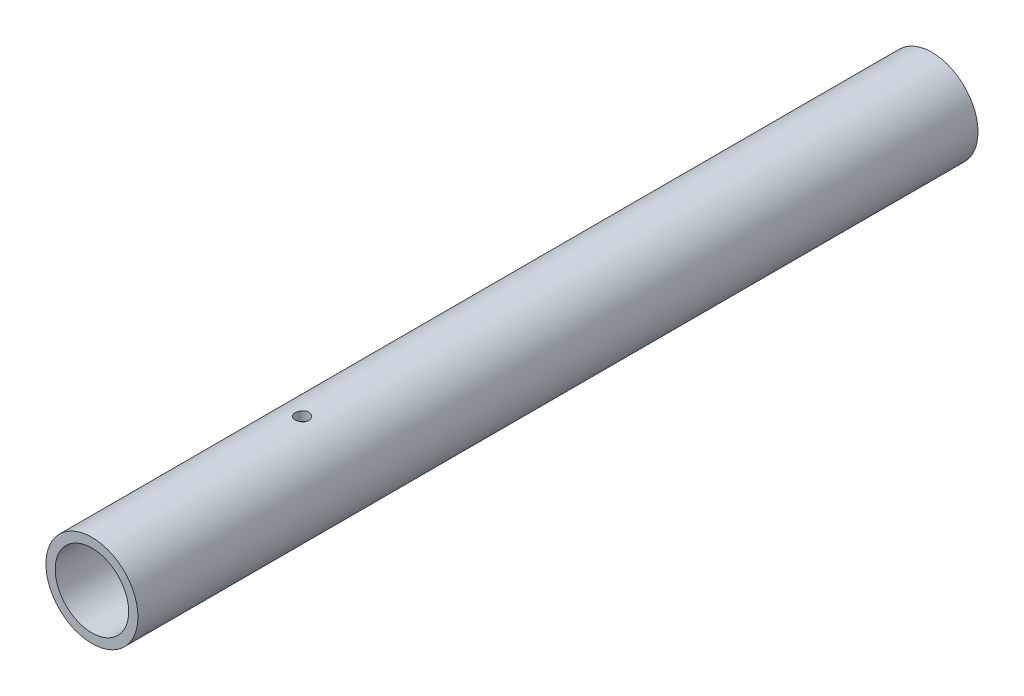
ISO-10303-21;
HEADER;
FILE_DESCRIPTION(('STEP AP214'),'2;1');
FILE_NAME('part.step','',(''),(''),'','','');
FILE_SCHEMA(('AUTOMOTIVE_DESIGN { 1 0 10303 214 1 1 1 1 }'));
ENDSEC;
DATA;
#1=APPLICATION_CONTEXT('core data for automotive mechanical design processes');
#2=APPLICATION_PROTOCOL_DEFINITION('international standard','automotive_design',2000,#1);
#3=PRODUCT_CONTEXT('',#1,'mechanical');
#4=PRODUCT('Part','Part','',(#3));
#5=PRODUCT_RELATED_PRODUCT_CATEGORY('part','',(#4));
#6=PRODUCT_DEFINITION_FORMATION('','',#4);
#7=PRODUCT_DEFINITION_CONTEXT('part definition',#1,'design');
#8=PRODUCT_DEFINITION('design','',#6,#7);
#9=PRODUCT_DEFINITION_SHAPE('','',#8);
#10=(LENGTH_UNIT() NAMED_UNIT(*) SI_UNIT(.MILLI.,.METRE.));
#11=(NAMED_UNIT(*) PLANE_ANGLE_UNIT() SI_UNIT($,.RADIAN.));
#12=(NAMED_UNIT(*) SI_UNIT($,.STERADIAN.) SOLID_ANGLE_UNIT());
#13=UNCERTAINTY_MEASURE_WITH_UNIT(LENGTH_MEASURE(1.E-05),#10,'distance_accuracy_value','');
#14=(GEOMETRIC_REPRESENTATION_CONTEXT(3) GLOBAL_UNCERTAINTY_ASSIGNED_CONTEXT((#13)) GLOBAL_UNIT_ASSIGNED_CONTEXT((#10,
#11,#12)) REPRESENTATION_CONTEXT('',''));
#15=CARTESIAN_POINT('',(0.,0.,0.));
#16=DIRECTION('',(0.,0.,1.));
#17=DIRECTION('',(1.,0.,0.));
#18=AXIS2_PLACEMENT_3D('',#15,#16,#17);
#19=CARTESIAN_POINT('',(-21.082,21.082,-304.8));
#20=DIRECTION('',(0.,0.,1.));
#21=DIRECTION('',(1.,0.,0.));
#22=AXIS2_PLACEMENT_3D('',#19,#20,#21);
#23=CYLINDRICAL_SURFACE('',#22,13.335);
#24=CARTESIAN_POINT('',(-21.082,21.082,-304.8));
#25=DIRECTION('',(0.,0.,1.));
#26=DIRECTION('',(1.,0.,0.));
#27=AXIS2_PLACEMENT_3D('',#24,#25,#26);
#28=CIRCLE('',#27,13.335);
#29=CARTESIAN_POINT('',(-7.747,21.082,-304.8));
#30=VERTEX_POINT('',#29);
#31=EDGE_CURVE('E24',#30,#30,#28,.T.);
#32=ORIENTED_EDGE('',*,*,#31,.F.);
#33=EDGE_LOOP('',(#32));
#34=FACE_BOUND('',#33,.T.);
#35=CARTESIAN_POINT('',(-21.082,21.082,0.));
#36=DIRECTION('',(0.,0.,1.));
#37=DIRECTION('',(1.,0.,0.));
#38=AXIS2_PLACEMENT_3D('',#35,#36,#37);
#39=CIRCLE('',#38,13.335);
#40=CARTESIAN_POINT('',(-7.747,21.082,0.));
#41=VERTEX_POINT('',#40);
#42=EDGE_CURVE('E38',#41,#41,#39,.T.);
#43=ORIENTED_EDGE('',*,*,#42,.T.);
#44=EDGE_LOOP('',(#43));
#45=FACE_BOUND('',#44,.T.);
#46=CARTESIAN_POINT('',(-21.082,7.747,-78.65745));
#47=CARTESIAN_POINT('',(-21.2187948592161,7.74700246138851,-78.6574447279434));
#48=CARTESIAN_POINT('',(-21.3556588089519,7.74912669516432,-78.6459892993906));
#49=CARTESIAN_POINT('',(-21.6255328892023,7.75739597096117,-78.6004980658493));
#50=CARTESIAN_POINT('',(-21.7585396182342,7.7635444555255,-78.5664429276031));
#51=CARTESIAN_POINT('',(-22.0167570063155,7.77917414800193,-78.4768280336677));
#52=CARTESIAN_POINT('',(-22.1419744849863,7.78865239090288,-78.4212874054762));
#53=CARTESIAN_POINT('',(-22.381301289392,7.80990543665334,-78.2903317601848));
#54=CARTESIAN_POINT('',(-22.4954115725284,7.82168004130124,-78.2149184581211));
#55=CARTESIAN_POINT('',(-22.7106192126991,7.84637781056411,-78.0454303196822));
#56=CARTESIAN_POINT('',(-22.8115692501581,7.8593116256834,-77.951169956784));
#57=CARTESIAN_POINT('',(-22.9963166393543,7.88479065235194,-77.7470625447916));
#58=CARTESIAN_POINT('',(-23.0801127842092,7.89733583650594,-77.6372143999206));
#59=CARTESIAN_POINT('',(-23.2287828884571,7.92072063313501,-77.4040131424123));
#60=CARTESIAN_POINT('',(-23.2935076576815,7.93154650780949,-77.2805634196347));
#61=CARTESIAN_POINT('',(-23.4012428236667,7.95011721664654,-77.0243098271869));
#62=CARTESIAN_POINT('',(-23.4442550265487,7.95786230706729,-76.8915067366076));
#63=CARTESIAN_POINT('',(-23.5068726758867,7.96928749596631,-76.6218902281098));
#64=CARTESIAN_POINT('',(-23.5267346384497,7.97301210848251,-76.4851383087179));
#65=CARTESIAN_POINT('',(-23.5432840700824,7.97610890094767,-76.2101961493011));
#66=CARTESIAN_POINT('',(-23.539973545933,7.97548145779287,-76.0720060348617));
#67=CARTESIAN_POINT('',(-23.5104801303221,7.96998557897495,-75.799964179379));
#68=CARTESIAN_POINT('',(-23.4845883521836,7.96517112371681,-75.6660796260605));
#69=CARTESIAN_POINT('',(-23.4111256016635,7.95192842897875,-75.4045878086399));
#70=CARTESIAN_POINT('',(-23.3635537365083,7.94350004067998,-75.2769808032834));
#71=CARTESIAN_POINT('',(-23.2477948262212,7.9239224125834,-75.0308114131764));
#72=CARTESIAN_POINT('',(-23.1794896961569,7.91275766005443,-74.9123058414145));
#73=CARTESIAN_POINT('',(-23.0242867525056,7.88897562685651,-74.6883284705087));
#74=CARTESIAN_POINT('',(-22.9373871140764,7.8763582036804,-74.5828579522129));
#75=CARTESIAN_POINT('',(-22.7458896784635,7.85085696289075,-74.3862621178351));
#76=CARTESIAN_POINT('',(-22.6410427550772,7.83797201270355,-74.2953794399826));
#77=CARTESIAN_POINT('',(-22.41746202952,7.81356408713008,-74.1324569100719));
#78=CARTESIAN_POINT('',(-22.2987280969616,7.8020411245338,-74.0604172349544));
#79=CARTESIAN_POINT('',(-22.0504947125879,7.78163342130704,-73.9371921300755));
#80=CARTESIAN_POINT('',(-21.920982766617,7.77275179868147,-73.8860313207487));
#81=CARTESIAN_POINT('',(-21.6550032946867,7.75865171938389,-73.8062582619009));
#82=CARTESIAN_POINT('',(-21.5185364836401,7.75343288701331,-73.7776436997364));
#83=CARTESIAN_POINT('',(-21.2446091877513,7.74729783901729,-73.7441117004924));
#84=CARTESIAN_POINT('',(-21.1071907192645,7.74632124742975,-73.7388617100524));
#85=CARTESIAN_POINT('',(-20.8334392593011,7.74861416766826,-73.7513167205142));
#86=CARTESIAN_POINT('',(-20.6971062166863,7.7518834782499,-73.7690206334622));
#87=CARTESIAN_POINT('',(-20.4304459559282,7.76226330061286,-73.8266043891773));
#88=CARTESIAN_POINT('',(-20.300081297479,7.76934475525787,-73.8663165461128));
#89=CARTESIAN_POINT('',(-20.0478602705809,7.78655813545782,-73.9666084838202));
#90=CARTESIAN_POINT('',(-19.9260044650044,7.79669026258393,-74.0271896435356));
#91=CARTESIAN_POINT('',(-19.6928368291016,7.81903165684358,-74.1682400760522));
#92=CARTESIAN_POINT('',(-19.5816504065329,7.83126179610768,-74.248913284951));
#93=CARTESIAN_POINT('',(-19.3742741582703,7.85638739771225,-74.4275811070687));
#94=CARTESIAN_POINT('',(-19.2780856835404,7.86928291984906,-74.5255772789865));
#95=CARTESIAN_POINT('',(-19.1021770879758,7.89448536944479,-74.737612622083));
#96=CARTESIAN_POINT('',(-19.0226835622907,7.90678264811425,-74.8518411170566));
#97=CARTESIAN_POINT('',(-18.884012814721,7.9292044022091,-75.0922256851818));
#98=CARTESIAN_POINT('',(-18.8248348539643,7.93932895665093,-75.2183813243332));
#99=CARTESIAN_POINT('',(-18.7287992161255,7.95618372699651,-75.4784544261316));
#100=CARTESIAN_POINT('',(-18.6918362442675,7.96292992983026,-75.6123319229694));
#101=CARTESIAN_POINT('',(-18.6409539378688,7.97230128953629,-75.8845325906455));
#102=CARTESIAN_POINT('',(-18.6270321017495,7.97492689378079,-76.0228552772066));
#103=CARTESIAN_POINT('',(-18.6227087345663,7.97573762670359,-76.2977513116025));
#104=CARTESIAN_POINT('',(-18.6319499077541,7.97399021106364,-76.4343189696051));
#105=CARTESIAN_POINT('',(-18.6729095536375,7.96640108859698,-76.7039189568548));
#106=CARTESIAN_POINT('',(-18.7046279027573,7.96055940427989,-76.8369513055343));
#107=CARTESIAN_POINT('',(-18.7894929713541,7.94546792055123,-77.095520882158));
#108=CARTESIAN_POINT('',(-18.8426022740794,7.93622407457414,-77.2210707603868));
#109=CARTESIAN_POINT('',(-18.9687030161139,7.91536537861531,-77.4615353759613));
#110=CARTESIAN_POINT('',(-19.0416957937877,7.90375036904277,-77.5764493967054));
#111=CARTESIAN_POINT('',(-19.2067390170938,7.87924794172376,-77.7941726100185));
#112=CARTESIAN_POINT('',(-19.2990499657535,7.86634454298404,-77.8967825650116));
#113=CARTESIAN_POINT('',(-19.499564819598,7.8408400336235,-78.0851756099915));
#114=CARTESIAN_POINT('',(-19.6077723720986,7.8282389931497,-78.1709548277576));
#115=CARTESIAN_POINT('',(-19.8381294068908,7.80463131293529,-78.3239426741416));
#116=CARTESIAN_POINT('',(-19.9603914244533,7.79363941269866,-78.3909841925568));
#117=CARTESIAN_POINT('',(-20.214604995074,7.77463226704775,-78.503468701982));
#118=CARTESIAN_POINT('',(-20.3465472195322,7.76661419979943,-78.5489321796519));
#119=CARTESIAN_POINT('',(-20.5794153798655,7.75611158584496,-78.6076351974588));
#120=CARTESIAN_POINT('',(-20.6789717553882,7.75271386847402,-78.6262841532356));
#121=CARTESIAN_POINT('',(-20.8796728460892,7.74815719207529,-78.6511933558369));
#122=CARTESIAN_POINT('',(-20.9808175231439,7.74699817939514,-78.6574538995599));
#123=CARTESIAN_POINT('',(-21.082,7.747,-78.65745));
#124=B_SPLINE_CURVE_WITH_KNOTS('',3,(#46,#47,#48,#49,#50,#51,#52,#53,#54,#55,#56,#57,#58,#59,
#60,#61,#62,#63,#64,#65,#66,#67,#68,#69,#70,#71,#72,#73,#74,#75,#76,#77,#78,#79,#80,#81,#82,#83,
#84,#85,#86,#87,#88,#89,#90,#91,#92,#93,#94,#95,#96,#97,#98,#99,#100,#101,#102,#103,#104,#105,
#106,#107,#108,#109,#110,#111,#112,#113,#114,#115,#116,#117,#118,#119,#120,#121,#122,#123),
.UNSPECIFIED.,.T.,.F.,(4,2,2,2,2,2,2,2,2,2,2,2,2,2,2,2,2,2,2,2,2,2,2,2,2,2,2,2,2,2,2,2,2,2,2,2,
2,2,4),(0.,0.41001457648515,0.820380358967035,1.23038165017484,1.64034756934889,
2.05456761964887,2.46881680287779,2.88622538554577,3.30359924109911,3.71630304912735,
4.12897111667219,4.53639649668784,4.94383865576287,5.35364635958971,5.76349429990501,
6.17957714159766,6.59566389027622,7.01223988202078,7.42877313861734,7.83935841955203,
8.24992424055249,8.6574040394724,9.06491076825971,9.47673551313093,9.88859733236826,
10.3057318683608,10.7228512316648,11.1379776091757,11.5530589134135,11.9617769992006,
12.370492837942,12.7784968402029,13.1865283121663,13.6004645260412,14.0144958621751,
14.432109733558,14.8493263161944,15.1526073380272,15.4558810913949),.UNSPECIFIED.);
#125=CARTESIAN_POINT('',(-21.082,7.747,-78.65745));
#126=VERTEX_POINT('',#125);
#127=EDGE_CURVE('E62',#126,#126,#124,.T.);
#128=ORIENTED_EDGE('',*,*,#127,.F.);
#129=EDGE_LOOP('',(#128));
#130=FACE_BOUND('',#129,.T.);
#131=CARTESIAN_POINT('',(-21.082,34.417,-78.65745));
#132=CARTESIAN_POINT('',(-20.9452051407839,34.4169975386115,-78.6574447279434));
#133=CARTESIAN_POINT('',(-20.8083411910481,34.4148733048357,-78.6459892993906));
#134=CARTESIAN_POINT('',(-20.5384671107977,34.4066040290388,-78.6004980658493));
#135=CARTESIAN_POINT('',(-20.4054603817658,34.4004555444745,-78.5664429276031));
#136=CARTESIAN_POINT('',(-20.1472429936845,34.3848258519981,-78.4768280336677));
#137=CARTESIAN_POINT('',(-20.0220255150137,34.3753476090971,-78.4212874054762));
#138=CARTESIAN_POINT('',(-19.782698710608,34.3540945633466,-78.2903317601848));
#139=CARTESIAN_POINT('',(-19.6685884274716,34.3423199586987,-78.2149184581211));
#140=CARTESIAN_POINT('',(-19.4533807873009,34.3176221894359,-78.0454303196822));
#141=CARTESIAN_POINT('',(-19.3524307498419,34.3046883743166,-77.951169956784));
#142=CARTESIAN_POINT('',(-19.1676833606457,34.2792093476481,-77.7470625447916));
#143=CARTESIAN_POINT('',(-19.0838872157908,34.2666641634941,-77.6372143999206));
#144=CARTESIAN_POINT('',(-18.9352171115429,34.243279366865,-77.4040131424123));
#145=CARTESIAN_POINT('',(-18.8704923423185,34.2324534921905,-77.2805634196347));
#146=CARTESIAN_POINT('',(-18.7627571763333,34.2138827833535,-77.0243098271869));
#147=CARTESIAN_POINT('',(-18.7197449734513,34.2061376929327,-76.8915067366076));
#148=CARTESIAN_POINT('',(-18.6571273241133,34.1947125040337,-76.6218902281098));
#149=CARTESIAN_POINT('',(-18.6372653615503,34.1909878915175,-76.4851383087179));
#150=CARTESIAN_POINT('',(-18.6207159299176,34.1878910990523,-76.2101961493011));
#151=CARTESIAN_POINT('',(-18.624026454067,34.1885185422071,-76.0720060348617));
#152=CARTESIAN_POINT('',(-18.6535198696779,34.1940144210251,-75.799964179379));
#153=CARTESIAN_POINT('',(-18.6794116478164,34.1988288762832,-75.6660796260605));
#154=CARTESIAN_POINT('',(-18.7528743983365,34.2120715710213,-75.4045878086399));
#155=CARTESIAN_POINT('',(-18.8004462634917,34.22049995932,-75.2769808032834));
#156=CARTESIAN_POINT('',(-18.9162051737788,34.2400775874166,-75.0308114131764));
#157=CARTESIAN_POINT('',(-18.9845103038431,34.2512423399456,-74.9123058414145));
#158=CARTESIAN_POINT('',(-19.1397132474944,34.2750243731435,-74.6883284705087));
#159=CARTESIAN_POINT('',(-19.2266128859236,34.2876417963196,-74.5828579522129));
#160=CARTESIAN_POINT('',(-19.4181103215365,34.3131430371093,-74.3862621178351));
#161=CARTESIAN_POINT('',(-19.5229572449228,34.3260279872964,-74.2953794399826));
#162=CARTESIAN_POINT('',(-19.74653797048,34.3504359128699,-74.1324569100719));
#163=CARTESIAN_POINT('',(-19.8652719030384,34.3619588754662,-74.0604172349544));
#164=CARTESIAN_POINT('',(-20.1135052874121,34.382366578693,-73.9371921300755));
#165=CARTESIAN_POINT('',(-20.243017233383,34.3912482013185,-73.8860313207487));
#166=CARTESIAN_POINT('',(-20.5089967053133,34.4053482806161,-73.8062582619009));
#167=CARTESIAN_POINT('',(-20.6454635163599,34.4105671129867,-73.7776436997364));
#168=CARTESIAN_POINT('',(-20.9193908122487,34.4167021609827,-73.7441117004924));
#169=CARTESIAN_POINT('',(-21.0568092807355,34.4176787525702,-73.7388617100524));
#170=CARTESIAN_POINT('',(-21.3305607406989,34.4153858323317,-73.7513167205142));
#171=CARTESIAN_POINT('',(-21.4668937833137,34.4121165217501,-73.7690206334622));
#172=CARTESIAN_POINT('',(-21.7335540440718,34.4017366993871,-73.8266043891773));
#173=CARTESIAN_POINT('',(-21.863918702521,34.3946552447421,-73.8663165461128));
#174=CARTESIAN_POINT('',(-22.1161397294191,34.3774418645422,-73.9666084838202));
#175=CARTESIAN_POINT('',(-22.2379955349956,34.3673097374161,-74.0271896435356));
#176=CARTESIAN_POINT('',(-22.4711631708984,34.3449683431564,-74.1682400760522));
#177=CARTESIAN_POINT('',(-22.5823495934671,34.3327382038923,-74.248913284951));
#178=CARTESIAN_POINT('',(-22.7897258417297,34.3076126022877,-74.4275811070687));
#179=CARTESIAN_POINT('',(-22.8859143164596,34.2947170801509,-74.5255772789865));
#180=CARTESIAN_POINT('',(-23.0618229120242,34.2695146305552,-74.737612622083));
#181=CARTESIAN_POINT('',(-23.1413164377093,34.2572173518858,-74.8518411170566));
#182=CARTESIAN_POINT('',(-23.279987185279,34.2347955977909,-75.0922256851818));
#183=CARTESIAN_POINT('',(-23.3391651460357,34.2246710433491,-75.2183813243332));
#184=CARTESIAN_POINT('',(-23.4352007838745,34.2078162730035,-75.4784544261316));
#185=CARTESIAN_POINT('',(-23.4721637557325,34.2010700701697,-75.6123319229694));
#186=CARTESIAN_POINT('',(-23.5230460621312,34.1916987104637,-75.8845325906455));
#187=CARTESIAN_POINT('',(-23.5369678982505,34.1890731062192,-76.0228552772066));
#188=CARTESIAN_POINT('',(-23.5412912654338,34.1882623732964,-76.2977513116025));
#189=CARTESIAN_POINT('',(-23.5320500922459,34.1900097889364,-76.4343189696051));
#190=CARTESIAN_POINT('',(-23.4910904463625,34.197598911403,-76.7039189568548));
#191=CARTESIAN_POINT('',(-23.4593720972427,34.2034405957201,-76.8369513055343));
#192=CARTESIAN_POINT('',(-23.3745070286459,34.2185320794488,-77.095520882158));
#193=CARTESIAN_POINT('',(-23.3213977259206,34.2277759254259,-77.2210707603868));
#194=CARTESIAN_POINT('',(-23.1952969838861,34.2486346213847,-77.4615353759613));
#195=CARTESIAN_POINT('',(-23.1223042062123,34.2602496309572,-77.5764493967054));
#196=CARTESIAN_POINT('',(-22.9572609829062,34.2847520582762,-77.7941726100185));
#197=CARTESIAN_POINT('',(-22.8649500342465,34.297655457016,-77.8967825650116));
#198=CARTESIAN_POINT('',(-22.664435180402,34.3231599663765,-78.0851756099915));
#199=CARTESIAN_POINT('',(-22.5562276279014,34.3357610068503,-78.1709548277576));
#200=CARTESIAN_POINT('',(-22.3258705931092,34.3593686870647,-78.3239426741416));
#201=CARTESIAN_POINT('',(-22.2036085755467,34.3703605873013,-78.3909841925568));
#202=CARTESIAN_POINT('',(-21.949395004926,34.3893677329523,-78.503468701982));
#203=CARTESIAN_POINT('',(-21.8174527804678,34.3973858002006,-78.5489321796519));
#204=CARTESIAN_POINT('',(-21.5845846201345,34.4078884141551,-78.6076351974588));
#205=CARTESIAN_POINT('',(-21.4850282446118,34.411286131526,-78.6262841532356));
#206=CARTESIAN_POINT('',(-21.2843271539108,34.4158428079247,-78.6511933558369));
#207=CARTESIAN_POINT('',(-21.1831824768561,34.4170018206049,-78.6574538995599));
#208=CARTESIAN_POINT('',(-21.082,34.417,-78.65745));
#209=B_SPLINE_CURVE_WITH_KNOTS('',3,(#131,#132,#133,#134,#135,#136,#137,#138,#139,#140,#141,
#142,#143,#144,#145,#146,#147,#148,#149,#150,#151,#152,#153,#154,#155,#156,#157,#158,#159,#160,
#161,#162,#163,#164,#165,#166,#167,#168,#169,#170,#171,#172,#173,#174,#175,#176,#177,#178,#179,
#180,#181,#182,#183,#184,#185,#186,#187,#188,#189,#190,#191,#192,#193,#194,#195,#196,#197,#198,
#199,#200,#201,#202,#203,#204,#205,#206,#207,#208),.UNSPECIFIED.,.T.,.F.,(4,2,2,2,2,2,2,2,2,2,2,
2,2,2,2,2,2,2,2,2,2,2,2,2,2,2,2,2,2,2,2,2,2,2,2,2,2,2,4),(0.,0.41001457648515,0.820380358967036,
1.23038165017484,1.64034756934889,2.05456761964887,2.46881680287779,2.8862253855458,
3.30359924109911,3.71630304912735,4.12897111667219,4.53639649668785,4.94383865576287,
5.35364635958971,5.76349429990501,6.17957714159766,6.59566389027623,7.01223988202077,
7.42877313861734,7.83935841955204,8.24992424055249,8.6574040394724,9.06491076825971,
9.47673551313093,9.88859733236826,10.3057318683608,10.7228512316648,11.1379776091757,
11.5530589134135,11.9617769992006,12.370492837942,12.7784968402029,13.1865283121663,
13.6004645260412,14.0144958621751,14.432109733558,14.8493263161944,15.1526073380272,
15.4558810913949),.UNSPECIFIED.);
#210=CARTESIAN_POINT('',(-21.082,34.417,-78.65745));
#211=VERTEX_POINT('',#210);
#212=EDGE_CURVE('E41',#211,#211,#209,.T.);
#213=ORIENTED_EDGE('',*,*,#212,.F.);
#214=EDGE_LOOP('',(#213));
#215=FACE_BOUND('',#214,.T.);
#216=ADVANCED_FACE('F12',(#34,#45,#130,#215),#23,.F.);
#217=CARTESIAN_POINT('',(-21.082,21.082,-304.8));
#218=DIRECTION('',(0.,0.,1.));
#219=DIRECTION('',(1.,0.,0.));
#220=AXIS2_PLACEMENT_3D('',#217,#218,#219);
#221=CYLINDRICAL_SURFACE('',#220,16.7005);
#222=CARTESIAN_POINT('',(-21.082,4.38149999999993,-78.65745));
#223=CARTESIAN_POINT('',(-21.2192410025861,4.38150217022764,-78.6574443172633));
#224=CARTESIAN_POINT('',(-21.3565623956143,4.38320947043393,-78.6459144631919));
#225=CARTESIAN_POINT('',(-21.6273689540258,4.38985592631601,-78.6001101597742));
#226=CARTESIAN_POINT('',(-21.7608502162954,4.39479825679205,-78.5658133668969));
#227=CARTESIAN_POINT('',(-22.0200180396953,4.40735919749008,-78.4755203931146));
#228=CARTESIAN_POINT('',(-22.1457103326025,4.41497581156103,-78.4195403938812));
#229=CARTESIAN_POINT('',(-22.385897404253,4.43204301368479,-78.287509131431));
#230=CARTESIAN_POINT('',(-22.5003937795525,4.44149333967203,-78.2114607357377));
#231=CARTESIAN_POINT('',(-22.7158207402294,4.46125610797714,-78.0408410916021));
#232=CARTESIAN_POINT('',(-22.8166548187989,4.47157392543233,-77.9461486019759));
#233=CARTESIAN_POINT('',(-23.0010624074876,4.49186656951296,-77.7411895979179));
#234=CARTESIAN_POINT('',(-23.0846349394977,4.50184137667537,-77.6309222015447));
#235=CARTESIAN_POINT('',(-23.2325209157727,4.52037083566303,-77.3972975113157));
#236=CARTESIAN_POINT('',(-23.2967413324265,4.52891854227709,-77.2738807317752));
#237=CARTESIAN_POINT('',(-23.4035056494003,4.54355286891186,-77.0178659029884));
#238=CARTESIAN_POINT('',(-23.4460506862938,4.54963961797227,-76.8852683355614));
#239=CARTESIAN_POINT('',(-23.5079575758216,4.55861017493004,-76.6156693841489));
#240=CARTESIAN_POINT('',(-23.5274843989345,4.56151676395097,-76.4787066534293));
#241=CARTESIAN_POINT('',(-23.5433115579708,4.5638671257459,-76.2034199981308));
#242=CARTESIAN_POINT('',(-23.5396131779794,4.563311089963,-76.0650961492283));
#243=CARTESIAN_POINT('',(-23.5092298042709,4.55881986212579,-75.7921771947428));
#244=CARTESIAN_POINT('',(-23.4827282970978,4.55491164436883,-75.6575611543372));
#245=CARTESIAN_POINT('',(-23.4077780629622,4.54419853790695,-75.3947075525631));
#246=CARTESIAN_POINT('',(-23.3593287365733,4.53739357008794,-75.2664701655109));
#247=CARTESIAN_POINT('',(-23.2416665440084,4.52162381709451,-75.019454347405));
#248=CARTESIAN_POINT('',(-23.1723757110282,4.51265094717217,-74.9007135919144));
#249=CARTESIAN_POINT('',(-23.015052973247,4.49356229566387,-74.6764751085356));
#250=CARTESIAN_POINT('',(-22.9270198840983,4.48344644187025,-74.5709782182144));
#251=CARTESIAN_POINT('',(-22.7337031901897,4.46309234898183,-74.3751585159882));
#252=CARTESIAN_POINT('',(-22.6282617795468,4.45285386871947,-74.2849914450624));
#253=CARTESIAN_POINT('',(-22.4036600538203,4.43349859776556,-74.1236095060202));
#254=CARTESIAN_POINT('',(-22.2844996826839,4.42438181165731,-74.0523947153427));
#255=CARTESIAN_POINT('',(-22.0357093989535,4.40828813116989,-73.9309318294017));
#256=CARTESIAN_POINT('',(-21.9060736736605,4.40131243531078,-73.8806954716035));
#257=CARTESIAN_POINT('',(-21.6400804191064,4.39029701398562,-73.8027494217297));
#258=CARTESIAN_POINT('',(-21.5037233276105,4.38625709758012,-73.7750382646292));
#259=CARTESIAN_POINT('',(-21.2295024730446,4.38159365374626,-73.743135682363));
#260=CARTESIAN_POINT('',(-21.0916641349996,4.38093901885359,-73.7387300929091));
#261=CARTESIAN_POINT('',(-20.8172166541374,4.38303530468459,-73.7529956484227));
#262=CARTESIAN_POINT('',(-20.6806074748632,4.38578612406444,-73.7716661066641));
#263=CARTESIAN_POINT('',(-20.4131427905492,4.39436498495105,-73.8313757006782));
#264=CARTESIAN_POINT('',(-20.2822635546725,4.40017870626027,-73.8723107697769));
#265=CARTESIAN_POINT('',(-20.0292261655705,4.41423349016355,-73.9752780368446));
#266=CARTESIAN_POINT('',(-19.9070684087839,4.42247466301131,-74.0373111930986));
#267=CARTESIAN_POINT('',(-19.6739980364468,4.44054552893848,-74.1812181108909));
#268=CARTESIAN_POINT('',(-19.5631703540769,4.45038596415434,-74.2632280559232));
#269=CARTESIAN_POINT('',(-19.356774875305,4.47052588724284,-74.4445706148625));
#270=CARTESIAN_POINT('',(-19.2612079312108,4.4808254007138,-74.5439041956418));
#271=CARTESIAN_POINT('',(-19.0872698274103,4.50082097799922,-74.7580265331705));
#272=CARTESIAN_POINT('',(-19.0090420400417,4.51051156777357,-74.8729323442112));
#273=CARTESIAN_POINT('',(-18.872998662043,4.52809597281138,-75.1143789935112));
#274=CARTESIAN_POINT('',(-18.8151825363919,4.5359898351679,-75.240919526697));
#275=CARTESIAN_POINT('',(-18.7218271060897,4.54904764859629,-75.501611777507));
#276=CARTESIAN_POINT('',(-18.6862116934773,4.55422091670073,-75.6357357532424));
#277=CARTESIAN_POINT('',(-18.6380260685937,4.561276809771,-75.9081430575069));
#278=CARTESIAN_POINT('',(-18.6254543299195,4.56315965269279,-76.0464261099238));
#279=CARTESIAN_POINT('',(-18.6237482142702,4.56341358601077,-76.3217975487836));
#280=CARTESIAN_POINT('',(-18.6343884363395,4.5618184495872,-76.4588845609534));
#281=CARTESIAN_POINT('',(-18.6783218848314,4.55536945775816,-76.7292971833747));
#282=CARTESIAN_POINT('',(-18.71161508032,4.55051560680268,-76.8626227987623));
#283=CARTESIAN_POINT('',(-18.7998308017396,4.53810773318024,-77.1216695342128));
#284=CARTESIAN_POINT('',(-18.8547381671704,4.53055560346834,-77.2473959133437));
#285=CARTESIAN_POINT('',(-18.9846012513694,4.51359971271564,-77.4878884088105));
#286=CARTESIAN_POINT('',(-19.059557597283,4.5041958937552,-77.602654182139));
#287=CARTESIAN_POINT('',(-19.2282120463707,4.4844873863608,-77.8191138162986));
#288=CARTESIAN_POINT('',(-19.3220772439782,4.47417516335743,-77.9206768138982));
#289=CARTESIAN_POINT('',(-19.5255319399101,4.45387512936404,-78.1066905461732));
#290=CARTESIAN_POINT('',(-19.6351250934428,4.44388739444926,-78.1911372919613));
#291=CARTESIAN_POINT('',(-19.8676048077276,4.42530155759623,-78.3409183780189));
#292=CARTESIAN_POINT('',(-19.9905585822699,4.41671108120421,-78.4061493188647));
#293=CARTESIAN_POINT('',(-20.2457440746554,4.40196264813273,-78.5149373896911));
#294=CARTESIAN_POINT('',(-20.3779659599812,4.39580215814263,-78.5585171038905));
#295=CARTESIAN_POINT('',(-20.6059938609505,4.3880238199316,-78.6128114887158));
#296=CARTESIAN_POINT('',(-20.7003882944617,4.38558987156475,-78.629525538698));
#297=CARTESIAN_POINT('',(-20.8905087814731,4.3823272138367,-78.6518467118515));
#298=CARTESIAN_POINT('',(-20.9862348193353,4.38149848564019,-78.6574539653478));
#299=CARTESIAN_POINT('',(-21.082,4.38149999999993,-78.65745));
#300=B_SPLINE_CURVE_WITH_KNOTS('',3,(#222,#223,#224,#225,#226,#227,#228,#229,#230,#231,#232,
#233,#234,#235,#236,#237,#238,#239,#240,#241,#242,#243,#244,#245,#246,#247,#248,#249,#250,#251,
#252,#253,#254,#255,#256,#257,#258,#259,#260,#261,#262,#263,#264,#265,#266,#267,#268,#269,#270,
#271,#272,#273,#274,#275,#276,#277,#278,#279,#280,#281,#282,#283,#284,#285,#286,#287,#288,#289,
#290,#291,#292,#293,#294,#295,#296,#297,#298,#299),.UNSPECIFIED.,.T.,.F.,(4,2,2,2,2,2,2,2,2,2,2,
2,2,2,2,2,2,2,2,2,2,2,2,2,2,2,2,2,2,2,2,2,2,2,2,2,2,2,4),(0.,0.411373088645835,0.82315049792333,
1.2346211975503,1.64603313495375,2.06021450565259,2.47441933911035,2.89058464983195,
3.30672813619849,3.71987064933668,4.13299032067574,4.54281656225306,4.9526539974467,
5.36404409199506,5.77546019053723,6.19083418843245,6.60620988351658,7.02181767156507,
7.43739842658156,7.84915352273241,8.26089636564909,8.67073102247499,9.0805842966683,
9.49331386503612,9.90606647617901,10.3221142694046,10.7381511565683,11.1527538368046,
11.5673290529477,11.9778964485713,12.3884632835396,12.7987426524889,13.2090348567502,
13.6231257305417,14.0373129961949,14.4536898970231,14.8696315618026,15.1566863025583,
15.4437376750522),.UNSPECIFIED.);
#301=CARTESIAN_POINT('',(-21.082,4.38149999999993,-78.65745));
#302=VERTEX_POINT('',#301);
#303=EDGE_CURVE('E43',#302,#302,#300,.T.);
#304=ORIENTED_EDGE('',*,*,#303,.T.);
#305=EDGE_LOOP('',(#304));
#306=FACE_BOUND('',#305,.T.);
#307=CARTESIAN_POINT('',(-21.082,21.082,-304.8));
#308=DIRECTION('',(0.,0.,1.));
#309=DIRECTION('',(1.,0.,0.));
#310=AXIS2_PLACEMENT_3D('',#307,#308,#309);
#311=CIRCLE('',#310,16.7005);
#312=CARTESIAN_POINT('',(-4.3815,21.082,-304.8));
#313=VERTEX_POINT('',#312);
#314=EDGE_CURVE('E8',#313,#313,#311,.T.);
#315=ORIENTED_EDGE('',*,*,#314,.T.);
#316=EDGE_LOOP('',(#315));
#317=FACE_BOUND('',#316,.T.);
#318=CARTESIAN_POINT('',(-21.082,21.082,0.));
#319=DIRECTION('',(0.,0.,1.));
#320=DIRECTION('',(1.,0.,0.));
#321=AXIS2_PLACEMENT_3D('',#318,#319,#320);
#322=CIRCLE('',#321,16.7005);
#323=CARTESIAN_POINT('',(-4.3815,21.082,0.));
#324=VERTEX_POINT('',#323);
#325=EDGE_CURVE('E34',#324,#324,#322,.T.);
#326=ORIENTED_EDGE('',*,*,#325,.F.);
#327=EDGE_LOOP('',(#326));
#328=FACE_BOUND('',#327,.T.);
#329=CARTESIAN_POINT('',(-21.082,37.7825,-78.65745));
#330=CARTESIAN_POINT('',(-20.9447589974139,37.7824978297723,-78.6574443172633));
#331=CARTESIAN_POINT('',(-20.8074376043857,37.780790529566,-78.6459144631919));
#332=CARTESIAN_POINT('',(-20.5366310459742,37.774144073684,-78.6001101597742));
#333=CARTESIAN_POINT('',(-20.4031497837046,37.769201743208,-78.5658133668969));
#334=CARTESIAN_POINT('',(-20.1439819603047,37.7566408025099,-78.4755203931146));
#335=CARTESIAN_POINT('',(-20.0182896673975,37.749024188439,-78.4195403938812));
#336=CARTESIAN_POINT('',(-19.778102595747,37.7319569863152,-78.287509131431));
#337=CARTESIAN_POINT('',(-19.6636062204475,37.722506660328,-78.2114607357377));
#338=CARTESIAN_POINT('',(-19.4481792597706,37.7027438920229,-78.0408410916021));
#339=CARTESIAN_POINT('',(-19.3473451812011,37.6924260745677,-77.9461486019759));
#340=CARTESIAN_POINT('',(-19.1629375925124,37.672133430487,-77.7411895979179));
#341=CARTESIAN_POINT('',(-19.0793650605023,37.6621586233246,-77.6309222015447));
#342=CARTESIAN_POINT('',(-18.9314790842273,37.643629164337,-77.3972975113157));
#343=CARTESIAN_POINT('',(-18.8672586675735,37.6350814577229,-77.2738807317753));
#344=CARTESIAN_POINT('',(-18.7604943505997,37.6204471310881,-77.0178659029884));
#345=CARTESIAN_POINT('',(-18.7179493137063,37.6143603820277,-76.8852683355614));
#346=CARTESIAN_POINT('',(-18.6560424241784,37.60538982507,-76.6156693841489));
#347=CARTESIAN_POINT('',(-18.6365156010656,37.602483236049,-76.4787066534293));
#348=CARTESIAN_POINT('',(-18.6206884420291,37.6001328742541,-76.2034199981308));
#349=CARTESIAN_POINT('',(-18.6243868220206,37.600688910037,-76.0650961492283));
#350=CARTESIAN_POINT('',(-18.6547701957291,37.6051801378742,-75.7921771947427));
#351=CARTESIAN_POINT('',(-18.6812717029022,37.6090883556312,-75.6575611543372));
#352=CARTESIAN_POINT('',(-18.7562219370378,37.6198014620931,-75.394707552563));
#353=CARTESIAN_POINT('',(-18.8046712634267,37.6266064299121,-75.2664701655108));
#354=CARTESIAN_POINT('',(-18.9223334559916,37.6423761829055,-75.0194543474049));
#355=CARTESIAN_POINT('',(-18.9916242889718,37.6513490528278,-74.9007135919143));
#356=CARTESIAN_POINT('',(-19.1489470267531,37.6704377043361,-74.6764751085355));
#357=CARTESIAN_POINT('',(-19.2369801159017,37.6805535581298,-74.5709782182144));
#358=CARTESIAN_POINT('',(-19.4302968098103,37.7009076510182,-74.3751585159882));
#359=CARTESIAN_POINT('',(-19.5357382204532,37.7111461312805,-74.2849914450624));
#360=CARTESIAN_POINT('',(-19.7603399461797,37.7305014022344,-74.1236095060202));
#361=CARTESIAN_POINT('',(-19.8795003173161,37.7396181883427,-74.0523947153427));
#362=CARTESIAN_POINT('',(-20.1282906010465,37.7557118688301,-73.9309318294017));
#363=CARTESIAN_POINT('',(-20.2579263263395,37.7626875646892,-73.8806954716035));
#364=CARTESIAN_POINT('',(-20.5239195808936,37.7737029860144,-73.8027494217297));
#365=CARTESIAN_POINT('',(-20.6602766723895,37.7777429024199,-73.7750382646292));
#366=CARTESIAN_POINT('',(-20.9344975269554,37.7824063462537,-73.743135682363));
#367=CARTESIAN_POINT('',(-21.0723358650004,37.7830609811464,-73.7387300929091));
#368=CARTESIAN_POINT('',(-21.3467833458626,37.7809646953154,-73.7529956484227));
#369=CARTESIAN_POINT('',(-21.4833925251368,37.7782138759356,-73.7716661066641));
#370=CARTESIAN_POINT('',(-21.7508572094508,37.769635015049,-73.8313757006782));
#371=CARTESIAN_POINT('',(-21.8817364453275,37.7638212937397,-73.8723107697769));
#372=CARTESIAN_POINT('',(-22.1347738344295,37.7497665098365,-73.9752780368446));
#373=CARTESIAN_POINT('',(-22.2569315912161,37.7415253369887,-74.0373111930986));
#374=CARTESIAN_POINT('',(-22.4900019635532,37.7234544710616,-74.1812181108909));
#375=CARTESIAN_POINT('',(-22.600829645923,37.7136140358457,-74.2632280559232));
#376=CARTESIAN_POINT('',(-22.807225124695,37.6934741127572,-74.4445706148625));
#377=CARTESIAN_POINT('',(-22.9027920687892,37.6831745992862,-74.5439041956418));
#378=CARTESIAN_POINT('',(-23.0767301725897,37.6631790220008,-74.7580265331705));
#379=CARTESIAN_POINT('',(-23.1549579599583,37.6534884322264,-74.8729323442112));
#380=CARTESIAN_POINT('',(-23.291001337957,37.6359040271886,-75.1143789935112));
#381=CARTESIAN_POINT('',(-23.3488174636081,37.6280101648321,-75.240919526697));
#382=CARTESIAN_POINT('',(-23.4421728939103,37.6149523514037,-75.501611777507));
#383=CARTESIAN_POINT('',(-23.4777883065227,37.6097790832993,-75.6357357532424));
#384=CARTESIAN_POINT('',(-23.5259739314063,37.602723190229,-75.9081430575069));
#385=CARTESIAN_POINT('',(-23.5385456700805,37.6008403473072,-76.0464261099238));
#386=CARTESIAN_POINT('',(-23.5402517857298,37.6005864139892,-76.3217975487836));
#387=CARTESIAN_POINT('',(-23.5296115636605,37.6021815504128,-76.4588845609534));
#388=CARTESIAN_POINT('',(-23.4856781151686,37.6086305422418,-76.7292971833747));
#389=CARTESIAN_POINT('',(-23.45238491968,37.6134843931973,-76.8626227987623));
#390=CARTESIAN_POINT('',(-23.3641691982604,37.6258922668198,-77.1216695342128));
#391=CARTESIAN_POINT('',(-23.3092618328296,37.6334443965317,-77.2473959133437));
#392=CARTESIAN_POINT('',(-23.1793987486306,37.6504002872843,-77.4878884088105));
#393=CARTESIAN_POINT('',(-23.104442402717,37.6598041062448,-77.602654182139));
#394=CARTESIAN_POINT('',(-22.9357879536293,37.6795126136392,-77.8191138162986));
#395=CARTESIAN_POINT('',(-22.8419227560218,37.6898248366426,-77.9206768138982));
#396=CARTESIAN_POINT('',(-22.6384680600899,37.710124870636,-78.1066905461732));
#397=CARTESIAN_POINT('',(-22.5288749065572,37.7201126055507,-78.1911372919613));
#398=CARTESIAN_POINT('',(-22.2963951922724,37.7386984424038,-78.3409183780189));
#399=CARTESIAN_POINT('',(-22.1734414177301,37.7472889187958,-78.4061493188647));
#400=CARTESIAN_POINT('',(-21.9182559253446,37.7620373518673,-78.5149373896911));
#401=CARTESIAN_POINT('',(-21.7860340400188,37.7681978418573,-78.5585171038905));
#402=CARTESIAN_POINT('',(-21.5580061390495,37.7759761800684,-78.6128114887158));
#403=CARTESIAN_POINT('',(-21.4636117055383,37.7784101284353,-78.629525538698));
#404=CARTESIAN_POINT('',(-21.2734912185269,37.7816727861633,-78.6518467118515));
#405=CARTESIAN_POINT('',(-21.1777651806647,37.7825015143597,-78.6574539653478));
#406=CARTESIAN_POINT('',(-21.082,37.7825,-78.65745));
#407=B_SPLINE_CURVE_WITH_KNOTS('',3,(#329,#330,#331,#332,#333,#334,#335,#336,#337,#338,#339,
#340,#341,#342,#343,#344,#345,#346,#347,#348,#349,#350,#351,#352,#353,#354,#355,#356,#357,#358,
#359,#360,#361,#362,#363,#364,#365,#366,#367,#368,#369,#370,#371,#372,#373,#374,#375,#376,#377,
#378,#379,#380,#381,#382,#383,#384,#385,#386,#387,#388,#389,#390,#391,#392,#393,#394,#395,#396,
#397,#398,#399,#400,#401,#402,#403,#404,#405,#406),.UNSPECIFIED.,.T.,.F.,(4,2,2,2,2,2,2,2,2,2,2,
2,2,2,2,2,2,2,2,2,2,2,2,2,2,2,2,2,2,2,2,2,2,2,2,2,2,2,4),(0.,0.411373088645834,
0.823150497923326,1.2346211975503,1.64603313495375,2.06021450565259,2.47441933911035,
2.89058464983192,3.30672813619847,3.71987064933667,4.13299032067573,4.54281656225308,
4.95265399744679,5.36404409199509,5.77546019053723,6.19083418843245,6.60620988351658,
7.02181767156508,7.43739842658161,7.84915352273245,8.26089636564908,8.67073102247499,
9.08058429666829,9.49331386503611,9.90606647617901,10.3221142694046,10.7381511565683,
11.1527538368046,11.5673290529477,11.9778964485713,12.3884632835396,12.7987426524889,
13.2090348567502,13.6231257305417,14.0373129961949,14.4536898970231,14.8696315618026,
15.1566863025583,15.4437376750522),.UNSPECIFIED.);
#408=CARTESIAN_POINT('',(-21.082,37.7825,-78.65745));
#409=VERTEX_POINT('',#408);
#410=EDGE_CURVE('E16',#409,#409,#407,.T.);
#411=ORIENTED_EDGE('',*,*,#410,.T.);
#412=EDGE_LOOP('',(#411));
#413=FACE_BOUND('',#412,.T.);
#414=ADVANCED_FACE('F48',(#306,#317,#328,#413),#221,.T.);
#415=CARTESIAN_POINT('',(-21.082,21.082,-304.8));
#416=DIRECTION('',(0.,0.,1.));
#417=DIRECTION('',(1.,0.,0.));
#418=AXIS2_PLACEMENT_3D('',#415,#416,#417);
#419=PLANE('',#418);
#420=ORIENTED_EDGE('',*,*,#31,.T.);
#421=EDGE_LOOP('',(#420));
#422=FACE_BOUND('',#421,.T.);
#423=ORIENTED_EDGE('',*,*,#314,.F.);
#424=EDGE_LOOP('',(#423));
#425=FACE_BOUND('',#424,.T.);
#426=ADVANCED_FACE('F57',(#422,#425),#419,.F.);
#427=CARTESIAN_POINT('',(-21.082,21.082,0.));
#428=DIRECTION('',(0.,0.,1.));
#429=DIRECTION('',(1.,0.,0.));
#430=AXIS2_PLACEMENT_3D('',#427,#428,#429);
#431=PLANE('',#430);
#432=ORIENTED_EDGE('',*,*,#42,.F.);
#433=EDGE_LOOP('',(#432));
#434=FACE_BOUND('',#433,.T.);
#435=ORIENTED_EDGE('',*,*,#325,.T.);
#436=EDGE_LOOP('',(#435));
#437=FACE_BOUND('',#436,.T.);
#438=ADVANCED_FACE('F90',(#434,#437),#431,.T.);
#439=CARTESIAN_POINT('',(-21.082,311.31621471874,-76.2));
#440=DIRECTION('',(0.,-1.,0.));
#441=DIRECTION('',(0.,0.,-1.));
#442=AXIS2_PLACEMENT_3D('',#439,#440,#441);
#443=CYLINDRICAL_SURFACE('',#442,2.45745);
#444=ORIENTED_EDGE('',*,*,#303,.F.);
#445=EDGE_LOOP('',(#444));
#446=FACE_BOUND('',#445,.T.);
#447=ORIENTED_EDGE('',*,*,#127,.T.);
#448=EDGE_LOOP('',(#447));
#449=FACE_BOUND('',#448,.T.);
#450=ADVANCED_FACE('F55',(#446,#449),#443,.F.);
#451=ORIENTED_EDGE('',*,*,#410,.F.);
#452=EDGE_LOOP('',(#451));
#453=FACE_BOUND('',#452,.T.);
#454=ORIENTED_EDGE('',*,*,#212,.T.);
#455=EDGE_LOOP('',(#454));
#456=FACE_BOUND('',#455,.T.);
#457=ADVANCED_FACE('F51',(#453,#456),#443,.F.);
#458=CLOSED_SHELL('',(#216,#414,#426,#438,#450,#457));
#459=MANIFOLD_SOLID_BREP('B1',#458);
#460=ADVANCED_BREP_SHAPE_REPRESENTATION('',(#18,#459),#14);
#461=SHAPE_DEFINITION_REPRESENTATION(#9,#460);
ENDSEC;
END-ISO-10303-21;
